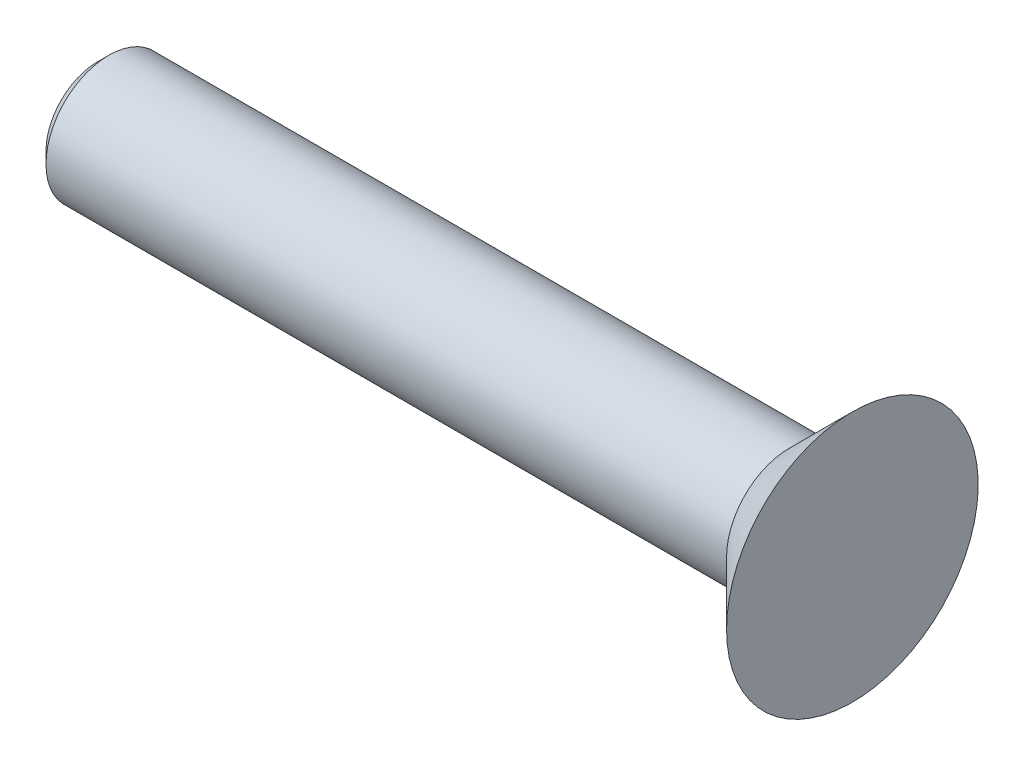
ISO-10303-21;
HEADER;
FILE_DESCRIPTION(('STEP AP214'),'2;1');
FILE_NAME('part.step','',(''),(''),'','','');
FILE_SCHEMA(('AUTOMOTIVE_DESIGN { 1 0 10303 214 1 1 1 1 }'));
ENDSEC;
DATA;
#1=APPLICATION_CONTEXT('core data for automotive mechanical design processes');
#2=APPLICATION_PROTOCOL_DEFINITION('international standard','automotive_design',2000,#1);
#3=PRODUCT_CONTEXT('',#1,'mechanical');
#4=PRODUCT('Part','Part','',(#3));
#5=PRODUCT_RELATED_PRODUCT_CATEGORY('part','',(#4));
#6=PRODUCT_DEFINITION_FORMATION('','',#4);
#7=PRODUCT_DEFINITION_CONTEXT('part definition',#1,'design');
#8=PRODUCT_DEFINITION('design','',#6,#7);
#9=PRODUCT_DEFINITION_SHAPE('','',#8);
#10=(LENGTH_UNIT() NAMED_UNIT(*) SI_UNIT(.MILLI.,.METRE.));
#11=(NAMED_UNIT(*) PLANE_ANGLE_UNIT() SI_UNIT($,.RADIAN.));
#12=(NAMED_UNIT(*) SI_UNIT($,.STERADIAN.) SOLID_ANGLE_UNIT());
#13=UNCERTAINTY_MEASURE_WITH_UNIT(LENGTH_MEASURE(1.E-05),#10,'distance_accuracy_value','');
#14=(GEOMETRIC_REPRESENTATION_CONTEXT(3) GLOBAL_UNCERTAINTY_ASSIGNED_CONTEXT((#13)) GLOBAL_UNIT_ASSIGNED_CONTEXT((#10,
#11,#12)) REPRESENTATION_CONTEXT('',''));
#15=CARTESIAN_POINT('',(0.,0.,0.));
#16=DIRECTION('',(0.,0.,1.));
#17=DIRECTION('',(1.,0.,0.));
#18=AXIS2_PLACEMENT_3D('',#15,#16,#17);
#19=CARTESIAN_POINT('',(0.,2.49999999999999,0.));
#20=DIRECTION('',(-1.,0.,0.));
#21=DIRECTION('',(0.,0.,1.));
#22=AXIS2_PLACEMENT_3D('',#19,#20,#21);
#23=PLANE('',#22);
#24=CARTESIAN_POINT('',(0.,0.,0.));
#25=DIRECTION('',(-1.,0.,0.));
#26=DIRECTION('',(0.,0.,1.));
#27=AXIS2_PLACEMENT_3D('',#24,#25,#26);
#28=CIRCLE('',#27,2.49999999999999);
#29=CARTESIAN_POINT('',(0.,0.,2.49999999999999));
#30=VERTEX_POINT('',#29);
#31=EDGE_CURVE('E35',#30,#30,#28,.T.);
#32=ORIENTED_EDGE('',*,*,#31,.F.);
#33=EDGE_LOOP('',(#32));
#34=FACE_BOUND('',#33,.T.);
#35=ADVANCED_FACE('F25',(#34),#23,.F.);
#36=CARTESIAN_POINT('',(0.,0.,0.));
#37=DIRECTION('',(1.,0.,0.));
#38=DIRECTION('',(0.,0.,-1.));
#39=AXIS2_PLACEMENT_3D('',#36,#37,#38);
#40=CONICAL_SURFACE('',#39,2.49999999999999,0.785398163397443);
#41=CARTESIAN_POINT('',(-1.25,0.,0.));
#42=DIRECTION('',(-1.,0.,0.));
#43=DIRECTION('',(0.,0.,1.));
#44=AXIS2_PLACEMENT_3D('',#41,#42,#43);
#45=CIRCLE('',#44,1.25);
#46=CARTESIAN_POINT('',(-1.25,0.,1.25));
#47=VERTEX_POINT('',#46);
#48=EDGE_CURVE('E39',#47,#47,#45,.T.);
#49=ORIENTED_EDGE('',*,*,#48,.F.);
#50=EDGE_LOOP('',(#49));
#51=FACE_BOUND('',#50,.T.);
#52=ORIENTED_EDGE('',*,*,#31,.T.);
#53=EDGE_LOOP('',(#52));
#54=FACE_BOUND('',#53,.T.);
#55=ADVANCED_FACE('F47',(#51,#54),#40,.T.);
#56=CARTESIAN_POINT('',(0.,0.,0.));
#57=DIRECTION('',(-1.,0.,0.));
#58=DIRECTION('',(0.,0.,1.));
#59=AXIS2_PLACEMENT_3D('',#56,#57,#58);
#60=CYLINDRICAL_SURFACE('',#59,1.25);
#61=CARTESIAN_POINT('',(-14.775,0.,0.));
#62=DIRECTION('',(1.,0.,0.));
#63=DIRECTION('',(0.,0.,-1.));
#64=AXIS2_PLACEMENT_3D('',#61,#62,#63);
#65=CIRCLE('',#64,1.25);
#66=CARTESIAN_POINT('',(-14.775,0.,-1.25));
#67=VERTEX_POINT('',#66);
#68=EDGE_CURVE('E10',#67,#67,#65,.T.);
#69=ORIENTED_EDGE('',*,*,#68,.T.);
#70=EDGE_LOOP('',(#69));
#71=FACE_BOUND('',#70,.T.);
#72=ORIENTED_EDGE('',*,*,#48,.T.);
#73=EDGE_LOOP('',(#72));
#74=FACE_BOUND('',#73,.T.);
#75=ADVANCED_FACE('F45',(#71,#74),#60,.T.);
#76=CARTESIAN_POINT('',(-15.,0.,0.));
#77=DIRECTION('',(1.,0.,0.));
#78=DIRECTION('',(0.,0.,-1.));
#79=AXIS2_PLACEMENT_3D('',#76,#77,#78);
#80=PLANE('',#79);
#81=CARTESIAN_POINT('',(-15.,0.,0.));
#82=DIRECTION('',(1.,0.,0.));
#83=DIRECTION('',(0.,0.,-1.));
#84=AXIS2_PLACEMENT_3D('',#81,#82,#83);
#85=CIRCLE('',#84,1.025);
#86=CARTESIAN_POINT('',(-15.,0.,-1.025));
#87=VERTEX_POINT('',#86);
#88=EDGE_CURVE('E31',#87,#87,#85,.F.);
#89=ORIENTED_EDGE('',*,*,#88,.T.);
#90=EDGE_LOOP('',(#89));
#91=FACE_BOUND('',#90,.T.);
#92=ADVANCED_FACE('F65',(#91),#80,.F.);
#93=CARTESIAN_POINT('',(-15.,0.,0.));
#94=DIRECTION('',(1.,0.,0.));
#95=DIRECTION('',(0.,0.,-1.));
#96=AXIS2_PLACEMENT_3D('',#93,#94,#95);
#97=CONICAL_SURFACE('',#96,1.025,0.785398163397454);
#98=ORIENTED_EDGE('',*,*,#68,.F.);
#99=EDGE_LOOP('',(#98));
#100=FACE_BOUND('',#99,.T.);
#101=ORIENTED_EDGE('',*,*,#88,.F.);
#102=EDGE_LOOP('',(#101));
#103=FACE_BOUND('',#102,.T.);
#104=ADVANCED_FACE('F72',(#100,#103),#97,.T.);
#105=CLOSED_SHELL('',(#35,#55,#75,#92,#104));
#106=MANIFOLD_SOLID_BREP('B2',#105);
#107=ADVANCED_BREP_SHAPE_REPRESENTATION('',(#18,#106),#14);
#108=SHAPE_DEFINITION_REPRESENTATION(#9,#107);
ENDSEC;
END-ISO-10303-21;
